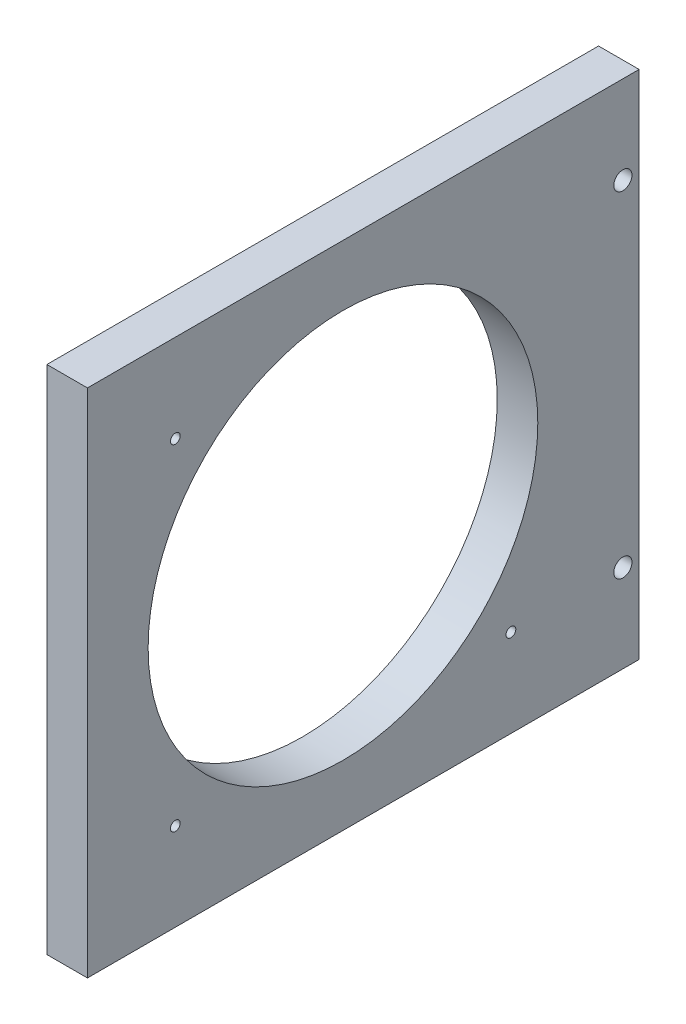
ISO-10303-21;
HEADER;
FILE_DESCRIPTION(('STEP AP214'),'2;1');
FILE_NAME('part.step','',(''),(''),'','','');
FILE_SCHEMA(('AUTOMOTIVE_DESIGN { 1 0 10303 214 1 1 1 1 }'));
ENDSEC;
DATA;
#1=APPLICATION_CONTEXT('core data for automotive mechanical design processes');
#2=APPLICATION_PROTOCOL_DEFINITION('international standard','automotive_design',2000,#1);
#3=PRODUCT_CONTEXT('',#1,'mechanical');
#4=PRODUCT('Part','Part','',(#3));
#5=PRODUCT_RELATED_PRODUCT_CATEGORY('part','',(#4));
#6=PRODUCT_DEFINITION_FORMATION('','',#4);
#7=PRODUCT_DEFINITION_CONTEXT('part definition',#1,'design');
#8=PRODUCT_DEFINITION('design','',#6,#7);
#9=PRODUCT_DEFINITION_SHAPE('','',#8);
#10=(LENGTH_UNIT() NAMED_UNIT(*) SI_UNIT(.MILLI.,.METRE.));
#11=(NAMED_UNIT(*) PLANE_ANGLE_UNIT() SI_UNIT($,.RADIAN.));
#12=(NAMED_UNIT(*) SI_UNIT($,.STERADIAN.) SOLID_ANGLE_UNIT());
#13=UNCERTAINTY_MEASURE_WITH_UNIT(LENGTH_MEASURE(1.E-05),#10,'distance_accuracy_value','');
#14=(GEOMETRIC_REPRESENTATION_CONTEXT(3) GLOBAL_UNCERTAINTY_ASSIGNED_CONTEXT((#13)) GLOBAL_UNIT_ASSIGNED_CONTEXT((#10,
#11,#12)) REPRESENTATION_CONTEXT('',''));
#15=CARTESIAN_POINT('',(0.,0.,0.));
#16=DIRECTION('',(0.,0.,1.));
#17=DIRECTION('',(1.,0.,0.));
#18=AXIS2_PLACEMENT_3D('',#15,#16,#17);
#19=CARTESIAN_POINT('',(6.35,0.,0.));
#20=DIRECTION('',(-1.,0.,0.));
#21=DIRECTION('',(0.,0.,1.));
#22=AXIS2_PLACEMENT_3D('',#19,#20,#21);
#23=PLANE('',#22);
#24=CARTESIAN_POINT('',(6.35,66.25,-83.82));
#25=DIRECTION('',(-1.,0.,0.));
#26=DIRECTION('',(0.,0.,-1.));
#27=AXIS2_PLACEMENT_3D('',#24,#25,#26);
#28=CIRCLE('',#27,1.42240000000001);
#29=CARTESIAN_POINT('',(6.35,66.25,-85.2424));
#30=VERTEX_POINT('',#29);
#31=EDGE_CURVE('E139',#30,#30,#28,.T.);
#32=ORIENTED_EDGE('',*,*,#31,.T.);
#33=EDGE_LOOP('',(#32));
#34=FACE_BOUND('',#33,.T.);
#35=CARTESIAN_POINT('',(6.35,13.75,-83.82));
#36=DIRECTION('',(-1.,0.,0.));
#37=DIRECTION('',(0.,0.,1.));
#38=AXIS2_PLACEMENT_3D('',#35,#36,#37);
#39=CIRCLE('',#38,1.42240000000001);
#40=CARTESIAN_POINT('',(6.35,13.75,-82.3976));
#41=VERTEX_POINT('',#40);
#42=EDGE_CURVE('E133',#41,#41,#39,.T.);
#43=ORIENTED_EDGE('',*,*,#42,.T.);
#44=EDGE_LOOP('',(#43));
#45=FACE_BOUND('',#44,.T.);
#46=CARTESIAN_POINT('',(6.35,66.25,-13.7547239379001));
#47=DIRECTION('',(-1.,0.,0.));
#48=DIRECTION('',(0.,0.,1.));
#49=AXIS2_PLACEMENT_3D('',#46,#47,#48);
#50=CIRCLE('',#49,0.762000000000001);
#51=CARTESIAN_POINT('',(6.35,66.25,-12.9927239379001));
#52=VERTEX_POINT('',#51);
#53=EDGE_CURVE('E127',#52,#52,#50,.T.);
#54=ORIENTED_EDGE('',*,*,#53,.T.);
#55=EDGE_LOOP('',(#54));
#56=FACE_BOUND('',#55,.T.);
#57=CARTESIAN_POINT('',(6.35,13.75,-13.7547239379001));
#58=DIRECTION('',(-1.,0.,0.));
#59=DIRECTION('',(0.,0.,-1.));
#60=AXIS2_PLACEMENT_3D('',#57,#58,#59);
#61=CIRCLE('',#60,0.762000000000001);
#62=CARTESIAN_POINT('',(6.35,13.75,-14.5167239379001));
#63=VERTEX_POINT('',#62);
#64=EDGE_CURVE('E121',#63,#63,#61,.T.);
#65=ORIENTED_EDGE('',*,*,#64,.T.);
#66=EDGE_LOOP('',(#65));
#67=FACE_BOUND('',#66,.T.);
#68=CARTESIAN_POINT('',(6.35,13.75,-66.2925582476535));
#69=DIRECTION('',(-1.,0.,0.));
#70=DIRECTION('',(0.,0.,1.));
#71=AXIS2_PLACEMENT_3D('',#68,#69,#70);
#72=CIRCLE('',#71,0.762000000000003);
#73=CARTESIAN_POINT('',(6.35,13.75,-65.5305582476535));
#74=VERTEX_POINT('',#73);
#75=EDGE_CURVE('E115',#74,#74,#72,.T.);
#76=ORIENTED_EDGE('',*,*,#75,.T.);
#77=EDGE_LOOP('',(#76));
#78=FACE_BOUND('',#77,.T.);
#79=DIRECTION('',(0.,-1.,0.));
#80=VECTOR('',#79,1.);
#81=CARTESIAN_POINT('',(6.35,0.,0.));
#82=LINE('',#81,#80);
#83=CARTESIAN_POINT('',(6.35,80.,0.));
#84=VERTEX_POINT('',#83);
#85=CARTESIAN_POINT('',(6.35,0.,0.));
#86=VERTEX_POINT('',#85);
#87=EDGE_CURVE('E85',#84,#86,#82,.T.);
#88=ORIENTED_EDGE('',*,*,#87,.T.);
#89=DIRECTION('',(0.,0.,-1.));
#90=VECTOR('',#89,1.);
#91=CARTESIAN_POINT('',(6.35,0.,0.));
#92=LINE('',#91,#90);
#93=CARTESIAN_POINT('',(6.35,0.,-86.36));
#94=VERTEX_POINT('',#93);
#95=EDGE_CURVE('E80',#86,#94,#92,.T.);
#96=ORIENTED_EDGE('',*,*,#95,.T.);
#97=DIRECTION('',(0.,1.,0.));
#98=VECTOR('',#97,1.);
#99=CARTESIAN_POINT('',(6.35,0.,-86.36));
#100=LINE('',#99,#98);
#101=CARTESIAN_POINT('',(6.35,80.,-86.36));
#102=VERTEX_POINT('',#101);
#103=EDGE_CURVE('E83',#94,#102,#100,.T.);
#104=ORIENTED_EDGE('',*,*,#103,.T.);
#105=DIRECTION('',(0.,0.,1.));
#106=VECTOR('',#105,1.);
#107=CARTESIAN_POINT('',(6.35,80.,0.));
#108=LINE('',#107,#106);
#109=EDGE_CURVE('E50',#102,#84,#108,.T.);
#110=ORIENTED_EDGE('',*,*,#109,.T.);
#111=EDGE_LOOP('',(#88,#96,#104,#110));
#112=FACE_BOUND('',#111,.T.);
#113=CARTESIAN_POINT('',(6.35,40.,-40.));
#114=DIRECTION('',(1.,0.,0.));
#115=DIRECTION('',(0.,0.,-1.));
#116=AXIS2_PLACEMENT_3D('',#113,#114,#115);
#117=CIRCLE('',#116,30.5);
#118=CARTESIAN_POINT('',(6.35,40.,-70.5));
#119=VERTEX_POINT('',#118);
#120=EDGE_CURVE('E100',#119,#119,#117,.T.);
#121=ORIENTED_EDGE('',*,*,#120,.F.);
#122=EDGE_LOOP('',(#121));
#123=FACE_BOUND('',#122,.T.);
#124=ADVANCED_FACE('F33',(#34,#45,#56,#67,#78,#112,#123),#23,.F.);
#125=CARTESIAN_POINT('',(0.,0.,0.));
#126=DIRECTION('',(-1.,0.,0.));
#127=DIRECTION('',(0.,0.,1.));
#128=AXIS2_PLACEMENT_3D('',#125,#126,#127);
#129=PLANE('',#128);
#130=CARTESIAN_POINT('',(0.,66.25,-83.82));
#131=DIRECTION('',(-1.,0.,0.));
#132=DIRECTION('',(0.,0.,-1.));
#133=AXIS2_PLACEMENT_3D('',#130,#131,#132);
#134=CIRCLE('',#133,1.42240000000001);
#135=CARTESIAN_POINT('',(0.,66.25,-85.2424));
#136=VERTEX_POINT('',#135);
#137=EDGE_CURVE('E142',#136,#136,#134,.T.);
#138=ORIENTED_EDGE('',*,*,#137,.F.);
#139=EDGE_LOOP('',(#138));
#140=FACE_BOUND('',#139,.T.);
#141=CARTESIAN_POINT('',(0.,13.75,-83.82));
#142=DIRECTION('',(-1.,0.,0.));
#143=DIRECTION('',(0.,0.,1.));
#144=AXIS2_PLACEMENT_3D('',#141,#142,#143);
#145=CIRCLE('',#144,1.42240000000001);
#146=CARTESIAN_POINT('',(0.,13.75,-82.3976));
#147=VERTEX_POINT('',#146);
#148=EDGE_CURVE('E136',#147,#147,#145,.T.);
#149=ORIENTED_EDGE('',*,*,#148,.F.);
#150=EDGE_LOOP('',(#149));
#151=FACE_BOUND('',#150,.T.);
#152=CARTESIAN_POINT('',(0.,66.25,-13.7547239379001));
#153=DIRECTION('',(-1.,0.,0.));
#154=DIRECTION('',(0.,0.,1.));
#155=AXIS2_PLACEMENT_3D('',#152,#153,#154);
#156=CIRCLE('',#155,0.762000000000001);
#157=CARTESIAN_POINT('',(0.,66.25,-12.9927239379001));
#158=VERTEX_POINT('',#157);
#159=EDGE_CURVE('E130',#158,#158,#156,.T.);
#160=ORIENTED_EDGE('',*,*,#159,.F.);
#161=EDGE_LOOP('',(#160));
#162=FACE_BOUND('',#161,.T.);
#163=CARTESIAN_POINT('',(0.,13.75,-13.7547239379001));
#164=DIRECTION('',(-1.,0.,0.));
#165=DIRECTION('',(0.,0.,-1.));
#166=AXIS2_PLACEMENT_3D('',#163,#164,#165);
#167=CIRCLE('',#166,0.762000000000001);
#168=CARTESIAN_POINT('',(0.,13.75,-14.5167239379001));
#169=VERTEX_POINT('',#168);
#170=EDGE_CURVE('E124',#169,#169,#167,.T.);
#171=ORIENTED_EDGE('',*,*,#170,.F.);
#172=EDGE_LOOP('',(#171));
#173=FACE_BOUND('',#172,.T.);
#174=CARTESIAN_POINT('',(0.,13.75,-66.2925582476535));
#175=DIRECTION('',(-1.,0.,0.));
#176=DIRECTION('',(0.,0.,1.));
#177=AXIS2_PLACEMENT_3D('',#174,#175,#176);
#178=CIRCLE('',#177,0.762000000000003);
#179=CARTESIAN_POINT('',(0.,13.75,-65.5305582476535));
#180=VERTEX_POINT('',#179);
#181=EDGE_CURVE('E118',#180,#180,#178,.T.);
#182=ORIENTED_EDGE('',*,*,#181,.F.);
#183=EDGE_LOOP('',(#182));
#184=FACE_BOUND('',#183,.T.);
#185=DIRECTION('',(0.,-1.,0.));
#186=VECTOR('',#185,1.);
#187=CARTESIAN_POINT('',(0.,0.,0.));
#188=LINE('',#187,#186);
#189=CARTESIAN_POINT('',(0.,80.,0.));
#190=VERTEX_POINT('',#189);
#191=CARTESIAN_POINT('',(0.,0.,0.));
#192=VERTEX_POINT('',#191);
#193=EDGE_CURVE('E97',#190,#192,#188,.T.);
#194=ORIENTED_EDGE('',*,*,#193,.F.);
#195=DIRECTION('',(0.,0.,1.));
#196=VECTOR('',#195,1.);
#197=CARTESIAN_POINT('',(0.,80.,0.));
#198=LINE('',#197,#196);
#199=CARTESIAN_POINT('',(0.,80.,-86.36));
#200=VERTEX_POINT('',#199);
#201=EDGE_CURVE('E73',#200,#190,#198,.T.);
#202=ORIENTED_EDGE('',*,*,#201,.F.);
#203=DIRECTION('',(0.,1.,0.));
#204=VECTOR('',#203,1.);
#205=CARTESIAN_POINT('',(0.,0.,-86.36));
#206=LINE('',#205,#204);
#207=CARTESIAN_POINT('',(0.,0.,-86.36));
#208=VERTEX_POINT('',#207);
#209=EDGE_CURVE('E67',#208,#200,#206,.T.);
#210=ORIENTED_EDGE('',*,*,#209,.F.);
#211=DIRECTION('',(0.,0.,-1.));
#212=VECTOR('',#211,1.);
#213=CARTESIAN_POINT('',(0.,0.,0.));
#214=LINE('',#213,#212);
#215=EDGE_CURVE('E89',#192,#208,#214,.T.);
#216=ORIENTED_EDGE('',*,*,#215,.F.);
#217=EDGE_LOOP('',(#194,#202,#210,#216));
#218=FACE_BOUND('',#217,.T.);
#219=CARTESIAN_POINT('',(0.,40.,-40.));
#220=DIRECTION('',(1.,0.,0.));
#221=DIRECTION('',(0.,0.,-1.));
#222=AXIS2_PLACEMENT_3D('',#219,#220,#221);
#223=CIRCLE('',#222,30.5);
#224=CARTESIAN_POINT('',(0.,40.,-70.5));
#225=VERTEX_POINT('',#224);
#226=EDGE_CURVE('E112',#225,#225,#223,.T.);
#227=ORIENTED_EDGE('',*,*,#226,.T.);
#228=EDGE_LOOP('',(#227));
#229=FACE_BOUND('',#228,.T.);
#230=ADVANCED_FACE('F108',(#140,#151,#162,#173,#184,#218,#229),#129,.T.);
#231=CARTESIAN_POINT('',(6.35,0.,0.));
#232=DIRECTION('',(0.,0.,-1.));
#233=DIRECTION('',(0.,1.,0.));
#234=AXIS2_PLACEMENT_3D('',#231,#232,#233);
#235=PLANE('',#234);
#236=ORIENTED_EDGE('',*,*,#193,.T.);
#237=DIRECTION('',(-1.,0.,0.));
#238=VECTOR('',#237,1.);
#239=CARTESIAN_POINT('',(6.35,0.,0.));
#240=LINE('',#239,#238);
#241=EDGE_CURVE('E11',#86,#192,#240,.T.);
#242=ORIENTED_EDGE('',*,*,#241,.F.);
#243=ORIENTED_EDGE('',*,*,#87,.F.);
#244=DIRECTION('',(-1.,0.,0.));
#245=VECTOR('',#244,1.);
#246=CARTESIAN_POINT('',(6.35,80.,0.));
#247=LINE('',#246,#245);
#248=EDGE_CURVE('E93',#84,#190,#247,.T.);
#249=ORIENTED_EDGE('',*,*,#248,.T.);
#250=EDGE_LOOP('',(#236,#242,#243,#249));
#251=FACE_BOUND('',#250,.T.);
#252=ADVANCED_FACE('F35',(#251),#235,.F.);
#253=CARTESIAN_POINT('',(6.35,0.,0.));
#254=DIRECTION('',(0.,1.,0.));
#255=DIRECTION('',(0.,0.,1.));
#256=AXIS2_PLACEMENT_3D('',#253,#254,#255);
#257=PLANE('',#256);
#258=ORIENTED_EDGE('',*,*,#215,.T.);
#259=DIRECTION('',(-1.,0.,0.));
#260=VECTOR('',#259,1.);
#261=CARTESIAN_POINT('',(6.35,0.,-86.36));
#262=LINE('',#261,#260);
#263=EDGE_CURVE('E42',#94,#208,#262,.T.);
#264=ORIENTED_EDGE('',*,*,#263,.F.);
#265=ORIENTED_EDGE('',*,*,#95,.F.);
#266=ORIENTED_EDGE('',*,*,#241,.T.);
#267=EDGE_LOOP('',(#258,#264,#265,#266));
#268=FACE_BOUND('',#267,.T.);
#269=ADVANCED_FACE('F88',(#268),#257,.F.);
#270=CARTESIAN_POINT('',(6.35,0.,-86.36));
#271=DIRECTION('',(0.,0.,1.));
#272=DIRECTION('',(1.,0.,0.));
#273=AXIS2_PLACEMENT_3D('',#270,#271,#272);
#274=PLANE('',#273);
#275=ORIENTED_EDGE('',*,*,#209,.T.);
#276=DIRECTION('',(-1.,0.,0.));
#277=VECTOR('',#276,1.);
#278=CARTESIAN_POINT('',(6.35,80.,-86.36));
#279=LINE('',#278,#277);
#280=EDGE_CURVE('E90',#102,#200,#279,.T.);
#281=ORIENTED_EDGE('',*,*,#280,.F.);
#282=ORIENTED_EDGE('',*,*,#103,.F.);
#283=ORIENTED_EDGE('',*,*,#263,.T.);
#284=EDGE_LOOP('',(#275,#281,#282,#283));
#285=FACE_BOUND('',#284,.T.);
#286=ADVANCED_FACE('F91',(#285),#274,.F.);
#287=CARTESIAN_POINT('',(6.35,80.,0.));
#288=DIRECTION('',(0.,-1.,0.));
#289=DIRECTION('',(0.,0.,-1.));
#290=AXIS2_PLACEMENT_3D('',#287,#288,#289);
#291=PLANE('',#290);
#292=ORIENTED_EDGE('',*,*,#201,.T.);
#293=ORIENTED_EDGE('',*,*,#248,.F.);
#294=ORIENTED_EDGE('',*,*,#109,.F.);
#295=ORIENTED_EDGE('',*,*,#280,.T.);
#296=EDGE_LOOP('',(#292,#293,#294,#295));
#297=FACE_BOUND('',#296,.T.);
#298=ADVANCED_FACE('F105',(#297),#291,.F.);
#299=CARTESIAN_POINT('',(6.35,40.,-40.));
#300=DIRECTION('',(-1.,0.,0.));
#301=DIRECTION('',(0.,0.,1.));
#302=AXIS2_PLACEMENT_3D('',#299,#300,#301);
#303=CYLINDRICAL_SURFACE('',#302,30.5);
#304=ORIENTED_EDGE('',*,*,#120,.T.);
#305=EDGE_LOOP('',(#304));
#306=FACE_BOUND('',#305,.T.);
#307=ORIENTED_EDGE('',*,*,#226,.F.);
#308=EDGE_LOOP('',(#307));
#309=FACE_BOUND('',#308,.T.);
#310=ADVANCED_FACE('F171',(#306,#309),#303,.F.);
#311=CARTESIAN_POINT('',(6.35,13.75,-66.2925582476535));
#312=DIRECTION('',(-1.,0.,0.));
#313=DIRECTION('',(0.,0.,1.));
#314=AXIS2_PLACEMENT_3D('',#311,#312,#313);
#315=CYLINDRICAL_SURFACE('',#314,0.762000000000003);
#316=ORIENTED_EDGE('',*,*,#75,.F.);
#317=EDGE_LOOP('',(#316));
#318=FACE_BOUND('',#317,.T.);
#319=ORIENTED_EDGE('',*,*,#181,.T.);
#320=EDGE_LOOP('',(#319));
#321=FACE_BOUND('',#320,.T.);
#322=ADVANCED_FACE('F168',(#318,#321),#315,.F.);
#323=CARTESIAN_POINT('',(6.35,13.75,-13.7547239379001));
#324=DIRECTION('',(-1.,0.,0.));
#325=DIRECTION('',(0.,0.,1.));
#326=AXIS2_PLACEMENT_3D('',#323,#324,#325);
#327=CYLINDRICAL_SURFACE('',#326,0.762000000000001);
#328=ORIENTED_EDGE('',*,*,#64,.F.);
#329=EDGE_LOOP('',(#328));
#330=FACE_BOUND('',#329,.T.);
#331=ORIENTED_EDGE('',*,*,#170,.T.);
#332=EDGE_LOOP('',(#331));
#333=FACE_BOUND('',#332,.T.);
#334=ADVANCED_FACE('F170',(#330,#333),#327,.F.);
#335=CARTESIAN_POINT('',(6.35,66.25,-13.7547239379001));
#336=DIRECTION('',(-1.,0.,0.));
#337=DIRECTION('',(0.,0.,1.));
#338=AXIS2_PLACEMENT_3D('',#335,#336,#337);
#339=CYLINDRICAL_SURFACE('',#338,0.762000000000001);
#340=ORIENTED_EDGE('',*,*,#53,.F.);
#341=EDGE_LOOP('',(#340));
#342=FACE_BOUND('',#341,.T.);
#343=ORIENTED_EDGE('',*,*,#159,.T.);
#344=EDGE_LOOP('',(#343));
#345=FACE_BOUND('',#344,.T.);
#346=ADVANCED_FACE('F178',(#342,#345),#339,.F.);
#347=CARTESIAN_POINT('',(6.35,13.75,-83.82));
#348=DIRECTION('',(-1.,0.,0.));
#349=DIRECTION('',(0.,0.,1.));
#350=AXIS2_PLACEMENT_3D('',#347,#348,#349);
#351=CYLINDRICAL_SURFACE('',#350,1.42240000000001);
#352=ORIENTED_EDGE('',*,*,#42,.F.);
#353=EDGE_LOOP('',(#352));
#354=FACE_BOUND('',#353,.T.);
#355=ORIENTED_EDGE('',*,*,#148,.T.);
#356=EDGE_LOOP('',(#355));
#357=FACE_BOUND('',#356,.T.);
#358=ADVANCED_FACE('F153',(#354,#357),#351,.F.);
#359=CARTESIAN_POINT('',(6.35,66.25,-83.82));
#360=DIRECTION('',(-1.,0.,0.));
#361=DIRECTION('',(0.,0.,1.));
#362=AXIS2_PLACEMENT_3D('',#359,#360,#361);
#363=CYLINDRICAL_SURFACE('',#362,1.42240000000001);
#364=ORIENTED_EDGE('',*,*,#31,.F.);
#365=EDGE_LOOP('',(#364));
#366=FACE_BOUND('',#365,.T.);
#367=ORIENTED_EDGE('',*,*,#137,.T.);
#368=EDGE_LOOP('',(#367));
#369=FACE_BOUND('',#368,.T.);
#370=ADVANCED_FACE('F150',(#366,#369),#363,.F.);
#371=CLOSED_SHELL('',(#124,#230,#252,#269,#286,#298,#310,#322,#334,#346,#358,#370));
#372=MANIFOLD_SOLID_BREP('B2',#371);
#373=ADVANCED_BREP_SHAPE_REPRESENTATION('',(#18,#372),#14);
#374=SHAPE_DEFINITION_REPRESENTATION(#9,#373);
ENDSEC;
END-ISO-10303-21;
